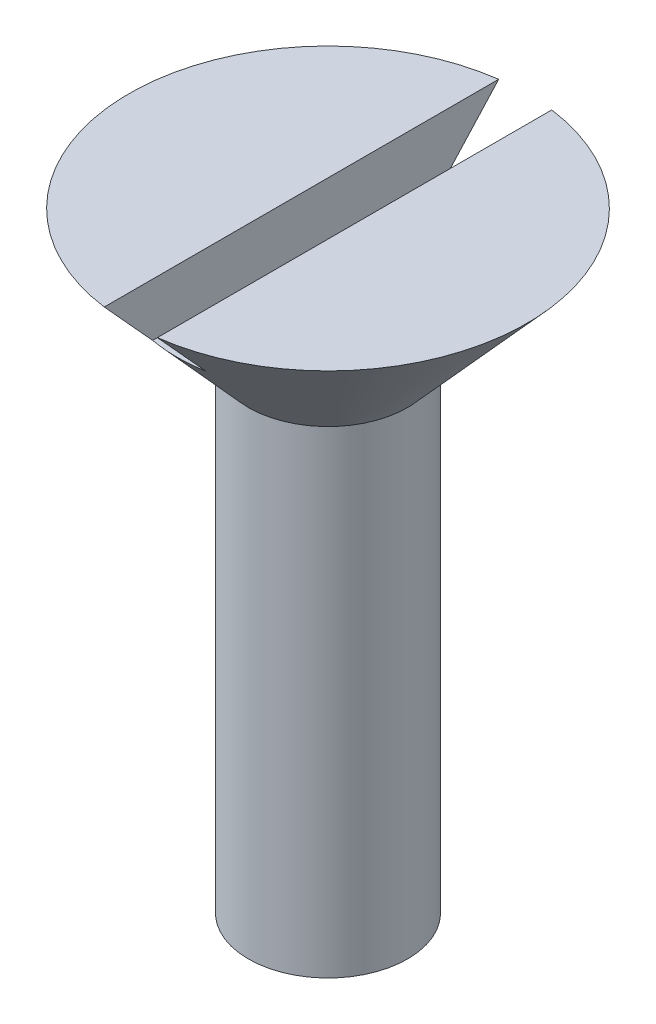
ISO-10303-21;
HEADER;
FILE_DESCRIPTION(('STEP AP214'),'2;1');
FILE_NAME('part.step','',(''),(''),'','','');
FILE_SCHEMA(('AUTOMOTIVE_DESIGN { 1 0 10303 214 1 1 1 1 }'));
ENDSEC;
DATA;
#1=APPLICATION_CONTEXT('core data for automotive mechanical design processes');
#2=APPLICATION_PROTOCOL_DEFINITION('international standard','automotive_design',2000,#1);
#3=PRODUCT_CONTEXT('',#1,'mechanical');
#4=PRODUCT('Part','Part','',(#3));
#5=PRODUCT_RELATED_PRODUCT_CATEGORY('part','',(#4));
#6=PRODUCT_DEFINITION_FORMATION('','',#4);
#7=PRODUCT_DEFINITION_CONTEXT('part definition',#1,'design');
#8=PRODUCT_DEFINITION('design','',#6,#7);
#9=PRODUCT_DEFINITION_SHAPE('','',#8);
#10=(LENGTH_UNIT() NAMED_UNIT(*) SI_UNIT(.MILLI.,.METRE.));
#11=(NAMED_UNIT(*) PLANE_ANGLE_UNIT() SI_UNIT($,.RADIAN.));
#12=(NAMED_UNIT(*) SI_UNIT($,.STERADIAN.) SOLID_ANGLE_UNIT());
#13=UNCERTAINTY_MEASURE_WITH_UNIT(LENGTH_MEASURE(1.E-05),#10,'distance_accuracy_value','');
#14=(GEOMETRIC_REPRESENTATION_CONTEXT(3) GLOBAL_UNCERTAINTY_ASSIGNED_CONTEXT((#13)) GLOBAL_UNIT_ASSIGNED_CONTEXT((#10,
#11,#12)) REPRESENTATION_CONTEXT('',''));
#15=CARTESIAN_POINT('',(0.,0.,0.));
#16=DIRECTION('',(0.,0.,1.));
#17=DIRECTION('',(1.,0.,0.));
#18=AXIS2_PLACEMENT_3D('',#15,#16,#17);
#19=CARTESIAN_POINT('',(7.5,24.7320508075689,0.));
#20=DIRECTION('',(0.,-1.,0.));
#21=DIRECTION('',(0.,0.,-1.));
#22=AXIS2_PLACEMENT_3D('',#19,#20,#21);
#23=PLANE('',#22);
#24=CARTESIAN_POINT('',(0.,24.7320508075689,0.));
#25=DIRECTION('',(0.,1.,0.));
#26=DIRECTION('',(0.,0.,1.));
#27=AXIS2_PLACEMENT_3D('',#24,#25,#26);
#28=CIRCLE('',#27,7.5);
#29=CARTESIAN_POINT('',(1.,24.7320508075689,7.43303437365925));
#30=VERTEX_POINT('',#29);
#31=CARTESIAN_POINT('',(1.,24.7320508075689,-7.43303437365925));
#32=VERTEX_POINT('',#31);
#33=EDGE_CURVE('E105',#30,#32,#28,.T.);
#34=ORIENTED_EDGE('',*,*,#33,.T.);
#35=DIRECTION('',(0.,0.,1.));
#36=VECTOR('',#35,1.);
#37=CARTESIAN_POINT('',(1.,24.7320508075689,0.));
#38=LINE('',#37,#36);
#39=EDGE_CURVE('E117',#32,#30,#38,.T.);
#40=ORIENTED_EDGE('',*,*,#39,.T.);
#41=EDGE_LOOP('',(#34,#40));
#42=FACE_BOUND('',#41,.T.);
#43=ADVANCED_FACE('F33',(#42),#23,.F.);
#44=CARTESIAN_POINT('',(-1.,24.7320508075689,-7.43303437365925));
#45=VERTEX_POINT('',#44);
#46=CARTESIAN_POINT('',(-1.,24.7320508075689,7.43303437365925));
#47=VERTEX_POINT('',#46);
#48=EDGE_CURVE('E97',#45,#47,#28,.T.);
#49=ORIENTED_EDGE('',*,*,#48,.T.);
#50=DIRECTION('',(0.,0.,-1.));
#51=VECTOR('',#50,1.);
#52=CARTESIAN_POINT('',(-1.,24.7320508075689,0.));
#53=LINE('',#52,#51);
#54=EDGE_CURVE('E53',#47,#45,#53,.T.);
#55=ORIENTED_EDGE('',*,*,#54,.T.);
#56=EDGE_LOOP('',(#49,#55));
#57=FACE_BOUND('',#56,.T.);
#58=ADVANCED_FACE('F35',(#57),#23,.F.);
#59=CARTESIAN_POINT('',(0.,19.7320508075689,0.));
#60=DIRECTION('',(0.,1.,0.));
#61=DIRECTION('',(0.,0.,1.));
#62=AXIS2_PLACEMENT_3D('',#59,#60,#61);
#63=CONICAL_SURFACE('',#62,3.,0.732815101786505);
#64=CARTESIAN_POINT('',(0.,22.7320508075689,0.));
#65=DIRECTION('',(0.,-1.,0.));
#66=DIRECTION('',(0.,0.,-1.));
#67=AXIS2_PLACEMENT_3D('',#64,#65,#66);
#68=CIRCLE('',#67,5.7);
#69=CARTESIAN_POINT('',(-1.,22.7320508075689,-5.61159513863928));
#70=VERTEX_POINT('',#69);
#71=CARTESIAN_POINT('',(1.,22.7320508075689,-5.61159513863928));
#72=VERTEX_POINT('',#71);
#73=EDGE_CURVE('E46',#70,#72,#68,.T.);
#74=ORIENTED_EDGE('',*,*,#73,.T.);
#75=CARTESIAN_POINT('',(1.,33.8118983778218,15.639925960075));
#76=CARTESIAN_POINT('',(1.,33.2359980294216,15.1205498993985));
#77=CARTESIAN_POINT('',(1.,32.6601431325921,14.6011234119019));
#78=CARTESIAN_POINT('',(1.,31.5085735118825,13.5621048361944));
#79=CARTESIAN_POINT('',(1.,30.9328587892883,13.0425127465579));
#80=CARTESIAN_POINT('',(1.,29.7814580768381,12.0029531057979));
#81=CARTESIAN_POINT('',(1.,29.2057721462678,11.4829854890004));
#82=CARTESIAN_POINT('',(1.,28.0547043135665,10.442723712531));
#83=CARTESIAN_POINT('',(1.,27.4793224088792,9.92242955568759));
#84=CARTESIAN_POINT('',(1.,26.3188100943632,8.87208385567957));
#85=CARTESIAN_POINT('',(1.,25.7336880097741,8.34202310932443));
#86=CARTESIAN_POINT('',(1.,24.8566315620184,7.54622564882452));
#87=CARTESIAN_POINT('',(1.,24.5643799933431,7.28083858614091));
#88=CARTESIAN_POINT('',(1.,23.9801736267029,6.74973925762148));
#89=CARTESIAN_POINT('',(1.,23.6882188280807,6.48402699250873));
#90=CARTESIAN_POINT('',(1.,23.1047908852559,5.95219637013094));
#91=CARTESIAN_POINT('',(1.,22.8133176530877,5.68607810942155));
#92=CARTESIAN_POINT('',(1.,22.2310018335616,5.15314725599336));
#93=CARTESIAN_POINT('',(1.,21.9401592517312,4.8863346572336));
#94=CARTESIAN_POINT('',(1.,21.3594856659971,4.35163565700624));
#95=CARTESIAN_POINT('',(1.,21.0696546155132,4.08374930623775));
#96=CARTESIAN_POINT('',(1.,20.6362428333509,3.6804886575543));
#97=CARTESIAN_POINT('',(1.,20.4919957253494,3.54583088303821));
#98=CARTESIAN_POINT('',(1.,20.2041271972768,3.27584853537228));
#99=CARTESIAN_POINT('',(1.,20.0605057740703,3.14052396557115));
#100=CARTESIAN_POINT('',(1.,19.8474130896113,2.93839586264938));
#101=CARTESIAN_POINT('',(1.,19.7775970578487,2.8719558555701));
#102=CARTESIAN_POINT('',(1.,19.6382314958873,2.73879618590339));
#103=CARTESIAN_POINT('',(1.,19.5686819668851,2.67207652206324));
#104=CARTESIAN_POINT('',(1.,19.3604988946684,2.47138733070519));
#105=CARTESIAN_POINT('',(1.,19.2223543844552,2.33690983664945));
#106=CARTESIAN_POINT('',(1.,18.9482982744016,2.06603115598737));
#107=CARTESIAN_POINT('',(1.,18.8123840227711,1.92963267620706));
#108=CARTESIAN_POINT('',(1.,18.6113058317861,1.72235315601585));
#109=CARTESIAN_POINT('',(1.,18.5447533546344,1.6528217778602));
#110=CARTESIAN_POINT('',(1.,18.4129629521583,1.51252689072349));
#111=CARTESIAN_POINT('',(1.,18.3477249263254,1.44176347672623));
#112=CARTESIAN_POINT('',(1.,18.2408080182636,1.32262998720648));
#113=CARTESIAN_POINT('',(1.,18.1985926692609,1.27474238310785));
#114=CARTESIAN_POINT('',(1.,18.1152770189139,1.17799155226375));
#115=CARTESIAN_POINT('',(1.,18.0741768688582,1.12912819469243));
#116=CARTESIAN_POINT('',(1.,17.9934604080059,1.03011261119105));
#117=CARTESIAN_POINT('',(1.,17.9538454028289,0.979959313655374));
#118=CARTESIAN_POINT('',(1.,17.8767681170031,0.878034100152696));
#119=CARTESIAN_POINT('',(1.,17.839305259575,0.826262623657756));
#120=CARTESIAN_POINT('',(1.,17.7571569506875,0.705450593232355));
#121=CARTESIAN_POINT('',(1.,17.7134780802959,0.635712680394886));
#122=CARTESIAN_POINT('',(1.,17.6347893784061,0.491436256519245));
#123=CARTESIAN_POINT('',(1.,17.5997589562607,0.41690969079339));
#124=CARTESIAN_POINT('',(1.,17.5535730329259,0.28757246617225));
#125=CARTESIAN_POINT('',(1.,17.5383568893439,0.234263588430568));
#126=CARTESIAN_POINT('',(1.,17.5170458725992,0.125901961961342));
#127=CARTESIAN_POINT('',(1.,17.5109259562591,0.0708544288812556));
#128=CARTESIAN_POINT('',(1.,17.5090012317522,-0.0396751999804776));
#129=CARTESIAN_POINT('',(1.,17.5132423271188,-0.0951581401200663));
#130=CARTESIAN_POINT('',(1.,17.5312336882127,-0.204586549748194));
#131=CARTESIAN_POINT('',(1.,17.5450032933184,-0.258528659642877));
#132=CARTESIAN_POINT('',(1.,17.5764391687001,-0.35376899807571));
#133=CARTESIAN_POINT('',(1.,17.5928469559512,-0.395503935722265));
#134=CARTESIAN_POINT('',(1.,17.6292455767461,-0.477399934646309));
#135=CARTESIAN_POINT('',(1.,17.6492393683691,-0.517559662955815));
#136=CARTESIAN_POINT('',(1.,17.6919799364054,-0.596612455692704));
#137=CARTESIAN_POINT('',(1.,17.7147394562399,-0.635498521464246));
#138=CARTESIAN_POINT('',(1.,17.7622399197949,-0.712005191385892));
#139=CARTESIAN_POINT('',(1.,17.7869799907059,-0.749626342704669));
#140=CARTESIAN_POINT('',(1.,17.8423512341989,-0.830225361818585));
#141=CARTESIAN_POINT('',(1.,17.873262973083,-0.873009307809947));
#142=CARTESIAN_POINT('',(1.,17.9366055570672,-0.957442119231861));
#143=CARTESIAN_POINT('',(1.,17.9690367230979,-0.99909074189618));
#144=CARTESIAN_POINT('',(1.,18.0680695482452,-1.12274267415565));
#145=CARTESIAN_POINT('',(1.,18.1363636067888,-1.20338639780183));
#146=CARTESIAN_POINT('',(1.,18.2758274770473,-1.36251188762246));
#147=CARTESIAN_POINT('',(1.,18.3470048712311,-1.4409868990047));
#148=CARTESIAN_POINT('',(1.,18.4910950863568,-1.59625670545727));
#149=CARTESIAN_POINT('',(1.,18.5640071142852,-1.6730522386387));
#150=CARTESIAN_POINT('',(1.,18.7113020249749,-1.82574746535657));
#151=CARTESIAN_POINT('',(1.,18.7856892495123,-1.90164295139213));
#152=CARTESIAN_POINT('',(1.,18.9353421450702,-2.0525775269337));
#153=CARTESIAN_POINT('',(1.,19.0106079107282,-2.12761652242298));
#154=CARTESIAN_POINT('',(1.,19.1616472462652,-2.27690850851912));
#155=CARTESIAN_POINT('',(1.,19.2374196632985,-2.35116266744937));
#156=CARTESIAN_POINT('',(1.,19.3894508392253,-2.49916498050392));
#157=CARTESIAN_POINT('',(1.,19.465709579314,-2.57291315396721));
#158=CARTESIAN_POINT('',(1.,19.6933057055148,-2.79189137484797));
#159=CARTESIAN_POINT('',(1.,19.8451908806489,-2.93655180149841));
#160=CARTESIAN_POINT('',(1.,20.1499078924106,-3.22487297454166));
#161=CARTESIAN_POINT('',(1.,20.3027397402209,-3.36853370908273));
#162=CARTESIAN_POINT('',(1.,20.762202339573,-3.79850867368539));
#163=CARTESIAN_POINT('',(1.,21.06978684067,-4.08380298895925));
#164=CARTESIAN_POINT('',(1.,21.6865016257717,-4.6531757890747));
#165=CARTESIAN_POINT('',(1.,21.995632895048,-4.93725320315508));
#166=CARTESIAN_POINT('',(1.,22.6146867806003,-5.50453011766616));
#167=CARTESIAN_POINT('',(1.,22.9246093785512,-5.78772963809636));
#168=CARTESIAN_POINT('',(1.,23.5436626979306,-6.35238355211487));
#169=CARTESIAN_POINT('',(1.,23.8527912888897,-6.63384028332803));
#170=CARTESIAN_POINT('',(1.,24.4713965579534,-7.19637464664735));
#171=CARTESIAN_POINT('',(1.,24.780873238146,-7.47745227645712));
#172=CARTESIAN_POINT('',(1.,25.7095208365048,-8.32015526110019));
#173=CARTESIAN_POINT('',(1.,26.3290534450499,-8.8813819566678));
#174=CARTESIAN_POINT('',(1.,27.5191284404871,-9.95843048619726));
#175=CARTESIAN_POINT('',(1.,28.0896301031463,-10.474297344379));
#176=CARTESIAN_POINT('',(1.,29.2309688324724,-11.505746178712));
#177=CARTESIAN_POINT('',(1.,29.8018059211346,-12.0213281305242));
#178=CARTESIAN_POINT('',(1.,30.9457939767524,-13.0541876927297));
#179=CARTESIAN_POINT('',(1.,31.5189456710493,-13.5714644973967));
#180=CARTESIAN_POINT('',(1.,32.6653493185193,-14.6058195526284));
#181=CARTESIAN_POINT('',(1.,33.2386012607868,-15.1228978152797));
#182=CARTESIAN_POINT('',(1.,33.8118983778218,-15.639925960075));
#183=B_SPLINE_CURVE_WITH_KNOTS('',3,(#75,#76,#77,#78,#79,#80,#81,#82,#83,#84,#85,#86,#87,#88,
#89,#90,#91,#92,#93,#94,#95,#96,#97,#98,#99,#100,#101,#102,#103,#104,#105,#106,#107,#108,#109,
#110,#111,#112,#113,#114,#115,#116,#117,#118,#119,#120,#121,#122,#123,#124,#125,#126,#127,#128,
#129,#130,#131,#132,#133,#134,#135,#136,#137,#138,#139,#140,#141,#142,#143,#144,#145,#146,#147,
#148,#149,#150,#151,#152,#153,#154,#155,#156,#157,#158,#159,#160,#161,#162,#163,#164,#165,#166,
#167,#168,#169,#170,#171,#172,#173,#174,#175,#176,#177,#178,#179,#180,#181,#182),.UNSPECIFIED.,
.F.,.F.,(4,2,2,2,2,2,2,2,2,2,2,2,2,2,2,2,2,2,2,2,2,2,2,2,2,2,2,2,2,2,2,2,2,2,2,2,2,2,2,2,2,2,2,
2,2,2,2,2,2,2,2,2,2,4),(0.,2.32652411297533,4.65306882365187,6.9803043228715,9.30751993299715,
11.6760610374247,12.8603629559083,14.0446622459477,15.2287138438658,16.4127757780927,
17.5967824482907,18.1887773685244,18.7807693187202,19.0699001197478,19.3590322173269,
19.9373935002252,20.515008320452,20.8037443454005,21.0924582079592,21.2839611949513,
21.475490032766,21.6671834769913,21.8588253050585,22.1053835295007,22.3513489490591,
22.5170548983931,22.6823037856817,22.8482861199841,23.0146063294087,23.1489438122481,
23.2833926234564,23.4184862509365,23.5535206682921,23.7118217646709,23.8701564491966,
24.1870675211082,24.5048743117122,24.8225385028926,25.1413434790176,25.4601831200775,
25.7784509239374,26.0967064949253,26.7259531478625,27.3552072481027,28.6137705788541,
29.873276614768,31.1327537435647,32.3869485041025,33.6411508280151,36.1489706723078,
38.4564186909855,40.7640402206434,43.0802231324853,45.396230318397),.UNSPECIFIED.);
#184=EDGE_CURVE('E11',#72,#32,#183,.T.);
#185=ORIENTED_EDGE('',*,*,#184,.T.);
#186=ORIENTED_EDGE('',*,*,#33,.F.);
#187=CARTESIAN_POINT('',(1.,22.7320508075689,5.61159513863928));
#188=VERTEX_POINT('',#187);
#189=EDGE_CURVE('E37',#30,#188,#183,.T.);
#190=ORIENTED_EDGE('',*,*,#189,.T.);
#191=CARTESIAN_POINT('',(-1.,22.7320508075689,5.61159513863928));
#192=VERTEX_POINT('',#191);
#193=EDGE_CURVE('E89',#188,#192,#68,.T.);
#194=ORIENTED_EDGE('',*,*,#193,.T.);
#195=CARTESIAN_POINT('',(-1.,33.8118983778218,-15.639925960075));
#196=CARTESIAN_POINT('',(-1.,33.2359980294216,-15.1205498993985));
#197=CARTESIAN_POINT('',(-1.,32.6601431325921,-14.6011234119019));
#198=CARTESIAN_POINT('',(-1.,31.5085735118825,-13.5621048361944));
#199=CARTESIAN_POINT('',(-1.,30.9328587892883,-13.0425127465579));
#200=CARTESIAN_POINT('',(-1.,29.7814580768381,-12.0029531057979));
#201=CARTESIAN_POINT('',(-1.,29.2057721462678,-11.4829854890004));
#202=CARTESIAN_POINT('',(-1.,28.0547043135665,-10.442723712531));
#203=CARTESIAN_POINT('',(-1.,27.4793224088792,-9.92242955568759));
#204=CARTESIAN_POINT('',(-1.,26.3188100943632,-8.87208385567957));
#205=CARTESIAN_POINT('',(-1.,25.7336880097741,-8.34202310932443));
#206=CARTESIAN_POINT('',(-1.,24.8566315620184,-7.54622564882452));
#207=CARTESIAN_POINT('',(-1.,24.5643799933431,-7.28083858614091));
#208=CARTESIAN_POINT('',(-1.,23.9801736267029,-6.74973925762148));
#209=CARTESIAN_POINT('',(-1.,23.6882188280807,-6.48402699250873));
#210=CARTESIAN_POINT('',(-1.,23.1047908852559,-5.95219637013094));
#211=CARTESIAN_POINT('',(-1.,22.8133176530877,-5.68607810942155));
#212=CARTESIAN_POINT('',(-1.,22.2310018335616,-5.15314725599336));
#213=CARTESIAN_POINT('',(-1.,21.9401592517312,-4.8863346572336));
#214=CARTESIAN_POINT('',(-1.,21.3594856659971,-4.35163565700624));
#215=CARTESIAN_POINT('',(-1.,21.0696546155132,-4.08374930623775));
#216=CARTESIAN_POINT('',(-1.,20.6362428333509,-3.6804886575543));
#217=CARTESIAN_POINT('',(-1.,20.4919957253494,-3.54583088303821));
#218=CARTESIAN_POINT('',(-1.,20.2041271972768,-3.27584853537228));
#219=CARTESIAN_POINT('',(-1.,20.0605057740703,-3.14052396557115));
#220=CARTESIAN_POINT('',(-1.,19.8474130896113,-2.93839586264938));
#221=CARTESIAN_POINT('',(-1.,19.7775970578487,-2.8719558555701));
#222=CARTESIAN_POINT('',(-1.,19.6382314958873,-2.73879618590339));
#223=CARTESIAN_POINT('',(-1.,19.5686819668851,-2.67207652206324));
#224=CARTESIAN_POINT('',(-1.,19.3604988946684,-2.47138733070519));
#225=CARTESIAN_POINT('',(-1.,19.2223543844552,-2.33690983664945));
#226=CARTESIAN_POINT('',(-1.,18.9482982744016,-2.06603115598737));
#227=CARTESIAN_POINT('',(-1.,18.8123840227711,-1.92963267620706));
#228=CARTESIAN_POINT('',(-1.,18.6113058317861,-1.72235315601585));
#229=CARTESIAN_POINT('',(-1.,18.5447533546344,-1.6528217778602));
#230=CARTESIAN_POINT('',(-1.,18.4129629521583,-1.51252689072349));
#231=CARTESIAN_POINT('',(-1.,18.3477249263254,-1.44176347672623));
#232=CARTESIAN_POINT('',(-1.,18.2408080182636,-1.32262998720648));
#233=CARTESIAN_POINT('',(-1.,18.1985926692609,-1.27474238310785));
#234=CARTESIAN_POINT('',(-1.,18.1152770189139,-1.17799155226375));
#235=CARTESIAN_POINT('',(-1.,18.0741768688582,-1.12912819469243));
#236=CARTESIAN_POINT('',(-1.,17.9934604080059,-1.03011261119105));
#237=CARTESIAN_POINT('',(-1.,17.9538454028289,-0.979959313655374));
#238=CARTESIAN_POINT('',(-1.,17.8767681170031,-0.878034100152696));
#239=CARTESIAN_POINT('',(-1.,17.839305259575,-0.826262623657756));
#240=CARTESIAN_POINT('',(-1.,17.7571569506875,-0.705450593232355));
#241=CARTESIAN_POINT('',(-1.,17.7134780802959,-0.635712680394886));
#242=CARTESIAN_POINT('',(-1.,17.6347893784061,-0.491436256519245));
#243=CARTESIAN_POINT('',(-1.,17.5997589562607,-0.41690969079339));
#244=CARTESIAN_POINT('',(-1.,17.5535730329259,-0.28757246617225));
#245=CARTESIAN_POINT('',(-1.,17.5383568893439,-0.234263588430568));
#246=CARTESIAN_POINT('',(-1.,17.5170458725992,-0.125901961961342));
#247=CARTESIAN_POINT('',(-1.,17.5109259562591,-0.0708544288812556));
#248=CARTESIAN_POINT('',(-1.,17.5090012317522,0.0396751999804776));
#249=CARTESIAN_POINT('',(-1.,17.5132423271188,0.0951581401200663));
#250=CARTESIAN_POINT('',(-1.,17.5312336882127,0.204586549748194));
#251=CARTESIAN_POINT('',(-1.,17.5450032933184,0.258528659642877));
#252=CARTESIAN_POINT('',(-1.,17.5764391687001,0.35376899807571));
#253=CARTESIAN_POINT('',(-1.,17.5928469559512,0.395503935722265));
#254=CARTESIAN_POINT('',(-1.,17.6292455767461,0.477399934646309));
#255=CARTESIAN_POINT('',(-1.,17.6492393683691,0.517559662955815));
#256=CARTESIAN_POINT('',(-1.,17.6919799364054,0.596612455692704));
#257=CARTESIAN_POINT('',(-1.,17.7147394562399,0.635498521464246));
#258=CARTESIAN_POINT('',(-1.,17.7622399197949,0.712005191385892));
#259=CARTESIAN_POINT('',(-1.,17.7869799907059,0.749626342704669));
#260=CARTESIAN_POINT('',(-1.,17.8423512341989,0.830225361818585));
#261=CARTESIAN_POINT('',(-1.,17.873262973083,0.873009307809947));
#262=CARTESIAN_POINT('',(-1.,17.9366055570672,0.957442119231861));
#263=CARTESIAN_POINT('',(-1.,17.9690367230979,0.99909074189618));
#264=CARTESIAN_POINT('',(-1.,18.0680695482452,1.12274267415565));
#265=CARTESIAN_POINT('',(-1.,18.1363636067888,1.20338639780183));
#266=CARTESIAN_POINT('',(-1.,18.2758274770473,1.36251188762246));
#267=CARTESIAN_POINT('',(-1.,18.3470048712311,1.4409868990047));
#268=CARTESIAN_POINT('',(-1.,18.4910950863568,1.59625670545727));
#269=CARTESIAN_POINT('',(-1.,18.5640071142852,1.6730522386387));
#270=CARTESIAN_POINT('',(-1.,18.7113020249749,1.82574746535657));
#271=CARTESIAN_POINT('',(-1.,18.7856892495123,1.90164295139213));
#272=CARTESIAN_POINT('',(-1.,18.9353421450702,2.0525775269337));
#273=CARTESIAN_POINT('',(-1.,19.0106079107282,2.12761652242298));
#274=CARTESIAN_POINT('',(-1.,19.1616472462652,2.27690850851912));
#275=CARTESIAN_POINT('',(-1.,19.2374196632985,2.35116266744937));
#276=CARTESIAN_POINT('',(-1.,19.3894508392253,2.49916498050392));
#277=CARTESIAN_POINT('',(-1.,19.465709579314,2.57291315396721));
#278=CARTESIAN_POINT('',(-1.,19.6933057055148,2.79189137484797));
#279=CARTESIAN_POINT('',(-1.,19.8451908806489,2.93655180149841));
#280=CARTESIAN_POINT('',(-1.,20.1499078924106,3.22487297454166));
#281=CARTESIAN_POINT('',(-1.,20.3027397402209,3.36853370908273));
#282=CARTESIAN_POINT('',(-1.,20.762202339573,3.79850867368539));
#283=CARTESIAN_POINT('',(-1.,21.06978684067,4.08380298895925));
#284=CARTESIAN_POINT('',(-1.,21.6865016257717,4.6531757890747));
#285=CARTESIAN_POINT('',(-1.,21.995632895048,4.93725320315508));
#286=CARTESIAN_POINT('',(-1.,22.6146867806003,5.50453011766616));
#287=CARTESIAN_POINT('',(-1.,22.9246093785512,5.78772963809636));
#288=CARTESIAN_POINT('',(-1.,23.5436626979306,6.35238355211487));
#289=CARTESIAN_POINT('',(-1.,23.8527912888897,6.63384028332803));
#290=CARTESIAN_POINT('',(-1.,24.4713965579534,7.19637464664735));
#291=CARTESIAN_POINT('',(-1.,24.780873238146,7.47745227645712));
#292=CARTESIAN_POINT('',(-1.,25.7095208365048,8.32015526110019));
#293=CARTESIAN_POINT('',(-1.,26.3290534450499,8.8813819566678));
#294=CARTESIAN_POINT('',(-1.,27.5191284404871,9.95843048619726));
#295=CARTESIAN_POINT('',(-1.,28.0896301031463,10.474297344379));
#296=CARTESIAN_POINT('',(-1.,29.2309688324724,11.505746178712));
#297=CARTESIAN_POINT('',(-1.,29.8018059211346,12.0213281305242));
#298=CARTESIAN_POINT('',(-1.,30.9457939767524,13.0541876927297));
#299=CARTESIAN_POINT('',(-1.,31.5189456710493,13.5714644973967));
#300=CARTESIAN_POINT('',(-1.,32.6653493185193,14.6058195526284));
#301=CARTESIAN_POINT('',(-1.,33.2386012607868,15.1228978152797));
#302=CARTESIAN_POINT('',(-1.,33.8118983778218,15.639925960075));
#303=B_SPLINE_CURVE_WITH_KNOTS('',3,(#195,#196,#197,#198,#199,#200,#201,#202,#203,#204,#205,
#206,#207,#208,#209,#210,#211,#212,#213,#214,#215,#216,#217,#218,#219,#220,#221,#222,#223,#224,
#225,#226,#227,#228,#229,#230,#231,#232,#233,#234,#235,#236,#237,#238,#239,#240,#241,#242,#243,
#244,#245,#246,#247,#248,#249,#250,#251,#252,#253,#254,#255,#256,#257,#258,#259,#260,#261,#262,
#263,#264,#265,#266,#267,#268,#269,#270,#271,#272,#273,#274,#275,#276,#277,#278,#279,#280,#281,
#282,#283,#284,#285,#286,#287,#288,#289,#290,#291,#292,#293,#294,#295,#296,#297,#298,#299,#300,
#301,#302),.UNSPECIFIED.,.F.,.F.,(4,2,2,2,2,2,2,2,2,2,2,2,2,2,2,2,2,2,2,2,2,2,2,2,2,2,2,2,2,2,2,
2,2,2,2,2,2,2,2,2,2,2,2,2,2,2,2,2,2,2,2,2,2,4),(0.,2.32652411297533,4.65306882365187,
6.9803043228715,9.30751993299715,11.6760610374247,12.8603629559083,14.0446622459477,
15.2287138438658,16.4127757780927,17.5967824482907,18.1887773685244,18.7807693187202,
19.0699001197478,19.3590322173269,19.9373935002252,20.515008320452,20.8037443454005,
21.0924582079592,21.2839611949513,21.475490032766,21.6671834769913,21.8588253050585,
22.1053835295007,22.3513489490591,22.5170548983931,22.6823037856817,22.8482861199841,
23.0146063294087,23.1489438122481,23.2833926234564,23.4184862509365,23.5535206682921,
23.7118217646709,23.8701564491966,24.1870675211082,24.5048743117122,24.8225385028926,
25.1413434790176,25.4601831200775,25.7784509239374,26.0967064949253,26.7259531478625,
27.3552072481027,28.6137705788541,29.873276614768,31.1327537435647,32.3869485041025,
33.6411508280151,36.1489706723078,38.4564186909855,40.7640402206434,43.0802231324853,
45.396230318397),.UNSPECIFIED.);
#304=EDGE_CURVE('E91',#192,#47,#303,.T.);
#305=ORIENTED_EDGE('',*,*,#304,.T.);
#306=ORIENTED_EDGE('',*,*,#48,.F.);
#307=EDGE_CURVE('E88',#45,#70,#303,.T.);
#308=ORIENTED_EDGE('',*,*,#307,.T.);
#309=EDGE_LOOP('',(#74,#185,#186,#190,#194,#305,#306,#308));
#310=FACE_BOUND('',#309,.T.);
#311=CARTESIAN_POINT('',(0.,19.7320508075689,0.));
#312=DIRECTION('',(0.,1.,0.));
#313=DIRECTION('',(0.,0.,1.));
#314=AXIS2_PLACEMENT_3D('',#311,#312,#313);
#315=CIRCLE('',#314,3.);
#316=CARTESIAN_POINT('',(0.,19.7320508075689,3.));
#317=VERTEX_POINT('',#316);
#318=EDGE_CURVE('E110',#317,#317,#315,.T.);
#319=ORIENTED_EDGE('',*,*,#318,.T.);
#320=EDGE_LOOP('',(#319));
#321=FACE_BOUND('',#320,.T.);
#322=ADVANCED_FACE('F94',(#310,#321),#63,.T.);
#323=CARTESIAN_POINT('',(0.,24.7320508075689,0.));
#324=DIRECTION('',(0.,1.,0.));
#325=DIRECTION('',(0.,0.,1.));
#326=AXIS2_PLACEMENT_3D('',#323,#324,#325);
#327=CYLINDRICAL_SURFACE('',#326,3.);
#328=ORIENTED_EDGE('',*,*,#318,.F.);
#329=EDGE_LOOP('',(#328));
#330=FACE_BOUND('',#329,.T.);
#331=CARTESIAN_POINT('',(0.,1.7320508075689,0.));
#332=DIRECTION('',(0.,1.,0.));
#333=DIRECTION('',(0.,0.,1.));
#334=AXIS2_PLACEMENT_3D('',#331,#332,#333);
#335=CIRCLE('',#334,3.);
#336=CARTESIAN_POINT('',(0.,1.7320508075689,3.));
#337=VERTEX_POINT('',#336);
#338=EDGE_CURVE('E114',#337,#337,#335,.T.);
#339=ORIENTED_EDGE('',*,*,#338,.T.);
#340=EDGE_LOOP('',(#339));
#341=FACE_BOUND('',#340,.T.);
#342=ADVANCED_FACE('F130',(#330,#341),#327,.T.);
#343=CARTESIAN_POINT('',(0.,0.,0.));
#344=DIRECTION('',(0.,1.,0.));
#345=DIRECTION('',(0.,0.,1.));
#346=AXIS2_PLACEMENT_3D('',#343,#344,#345);
#347=CONICAL_SURFACE('',#346,0.,1.04719755119659);
#348=ORIENTED_EDGE('',*,*,#338,.F.);
#349=EDGE_LOOP('',(#348));
#350=FACE_BOUND('',#349,.T.);
#351=CARTESIAN_POINT('',(0.,0.,0.));
#352=VERTEX_POINT('',#351);
#353=VERTEX_LOOP('',#352);
#354=FACE_BOUND('',#353,.T.);
#355=ADVANCED_FACE('F134',(#350,#354),#347,.T.);
#356=CARTESIAN_POINT('',(1.,22.7320508075689,-7.5));
#357=DIRECTION('',(1.,0.,0.));
#358=DIRECTION('',(0.,0.,-1.));
#359=AXIS2_PLACEMENT_3D('',#356,#357,#358);
#360=PLANE('',#359);
#361=ORIENTED_EDGE('',*,*,#39,.F.);
#362=ORIENTED_EDGE('',*,*,#184,.F.);
#363=DIRECTION('',(0.,0.,1.));
#364=VECTOR('',#363,1.);
#365=CARTESIAN_POINT('',(1.,22.7320508075689,-7.5));
#366=LINE('',#365,#364);
#367=EDGE_CURVE('E85',#72,#188,#366,.T.);
#368=ORIENTED_EDGE('',*,*,#367,.T.);
#369=ORIENTED_EDGE('',*,*,#189,.F.);
#370=EDGE_LOOP('',(#361,#362,#368,#369));
#371=FACE_BOUND('',#370,.T.);
#372=ADVANCED_FACE('F121',(#371),#360,.F.);
#373=CARTESIAN_POINT('',(-1.,22.7320508075689,-7.5));
#374=DIRECTION('',(0.,-1.,0.));
#375=DIRECTION('',(0.,0.,-1.));
#376=AXIS2_PLACEMENT_3D('',#373,#374,#375);
#377=PLANE('',#376);
#378=ORIENTED_EDGE('',*,*,#367,.F.);
#379=ORIENTED_EDGE('',*,*,#73,.F.);
#380=DIRECTION('',(0.,0.,1.));
#381=VECTOR('',#380,1.);
#382=CARTESIAN_POINT('',(-1.,22.7320508075689,-7.5));
#383=LINE('',#382,#381);
#384=EDGE_CURVE('E82',#70,#192,#383,.T.);
#385=ORIENTED_EDGE('',*,*,#384,.T.);
#386=ORIENTED_EDGE('',*,*,#193,.F.);
#387=EDGE_LOOP('',(#378,#379,#385,#386));
#388=FACE_BOUND('',#387,.T.);
#389=ADVANCED_FACE('F81',(#388),#377,.F.);
#390=CARTESIAN_POINT('',(-1.,22.7320508075689,-7.5));
#391=DIRECTION('',(-1.,0.,0.));
#392=DIRECTION('',(0.,0.,1.));
#393=AXIS2_PLACEMENT_3D('',#390,#391,#392);
#394=PLANE('',#393);
#395=ORIENTED_EDGE('',*,*,#54,.F.);
#396=ORIENTED_EDGE('',*,*,#304,.F.);
#397=ORIENTED_EDGE('',*,*,#384,.F.);
#398=ORIENTED_EDGE('',*,*,#307,.F.);
#399=EDGE_LOOP('',(#395,#396,#397,#398));
#400=FACE_BOUND('',#399,.T.);
#401=ADVANCED_FACE('F90',(#400),#394,.F.);
#402=CLOSED_SHELL('',(#43,#58,#322,#342,#355,#372,#389,#401));
#403=MANIFOLD_SOLID_BREP('B2',#402);
#404=ADVANCED_BREP_SHAPE_REPRESENTATION('',(#18,#403),#14);
#405=SHAPE_DEFINITION_REPRESENTATION(#9,#404);
ENDSEC;
END-ISO-10303-21;
